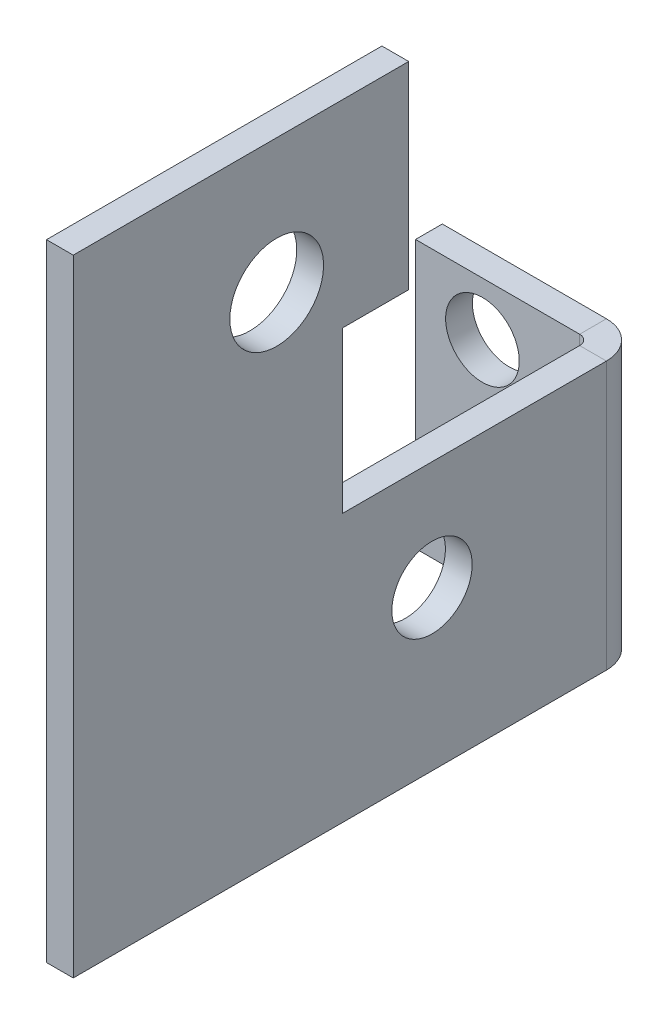
ISO-10303-21;
HEADER;
FILE_DESCRIPTION(('STEP AP214'),'2;1');
FILE_NAME('part.step','',(''),(''),'','','');
FILE_SCHEMA(('AUTOMOTIVE_DESIGN { 1 0 10303 214 1 1 1 1 }'));
ENDSEC;
DATA;
#1=APPLICATION_CONTEXT('core data for automotive mechanical design processes');
#2=APPLICATION_PROTOCOL_DEFINITION('international standard','automotive_design',2000,#1);
#3=PRODUCT_CONTEXT('',#1,'mechanical');
#4=PRODUCT('Part','Part','',(#3));
#5=PRODUCT_RELATED_PRODUCT_CATEGORY('part','',(#4));
#6=PRODUCT_DEFINITION_FORMATION('','',#4);
#7=PRODUCT_DEFINITION_CONTEXT('part definition',#1,'design');
#8=PRODUCT_DEFINITION('design','',#6,#7);
#9=PRODUCT_DEFINITION_SHAPE('','',#8);
#10=(LENGTH_UNIT() NAMED_UNIT(*) SI_UNIT(.MILLI.,.METRE.));
#11=(NAMED_UNIT(*) PLANE_ANGLE_UNIT() SI_UNIT($,.RADIAN.));
#12=(NAMED_UNIT(*) SI_UNIT($,.STERADIAN.) SOLID_ANGLE_UNIT());
#13=UNCERTAINTY_MEASURE_WITH_UNIT(LENGTH_MEASURE(1.E-05),#10,'distance_accuracy_value','');
#14=(GEOMETRIC_REPRESENTATION_CONTEXT(3) GLOBAL_UNCERTAINTY_ASSIGNED_CONTEXT((#13)) GLOBAL_UNIT_ASSIGNED_CONTEXT((#10,
#11,#12)) REPRESENTATION_CONTEXT('',''));
#15=CARTESIAN_POINT('',(0.,0.,0.));
#16=DIRECTION('',(0.,0.,1.));
#17=DIRECTION('',(1.,0.,0.));
#18=AXIS2_PLACEMENT_3D('',#15,#16,#17);
#19=CARTESIAN_POINT('',(2.,0.,35.2));
#20=DIRECTION('',(-1.,0.,0.));
#21=DIRECTION('',(0.,0.,1.));
#22=AXIS2_PLACEMENT_3D('',#19,#20,#21);
#23=PLANE('',#22);
#24=CARTESIAN_POINT('',(2.,40.,20.));
#25=DIRECTION('',(-1.,0.,0.));
#26=DIRECTION('',(0.,0.,1.));
#27=AXIS2_PLACEMENT_3D('',#24,#25,#26);
#28=CIRCLE('',#27,3.5);
#29=CARTESIAN_POINT('',(2.,40.,23.5));
#30=VERTEX_POINT('',#29);
#31=EDGE_CURVE('E256',#30,#30,#28,.T.);
#32=ORIENTED_EDGE('',*,*,#31,.T.);
#33=EDGE_LOOP('',(#32));
#34=FACE_BOUND('',#33,.T.);
#35=CARTESIAN_POINT('',(2.,15.0902098695956,8.3960026));
#36=DIRECTION('',(-1.,0.,0.));
#37=DIRECTION('',(0.,0.,1.));
#38=AXIS2_PLACEMENT_3D('',#35,#36,#37);
#39=CIRCLE('',#38,3.);
#40=CARTESIAN_POINT('',(2.,15.0902098695956,11.3960026));
#41=VERTEX_POINT('',#40);
#42=EDGE_CURVE('E229',#41,#41,#39,.T.);
#43=ORIENTED_EDGE('',*,*,#42,.T.);
#44=EDGE_LOOP('',(#43));
#45=FACE_BOUND('',#44,.T.);
#46=DIRECTION('',(0.,-1.,0.));
#47=VECTOR('',#46,1.);
#48=CARTESIAN_POINT('',(2.,3.23,-4.6334));
#49=LINE('',#48,#47);
#50=CARTESIAN_POINT('',(2.,3.23,-4.6334));
#51=VERTEX_POINT('',#50);
#52=CARTESIAN_POINT('',(2.,23.23,-4.6334));
#53=VERTEX_POINT('',#52);
#54=EDGE_CURVE('E156',#51,#53,#49,.F.);
#55=ORIENTED_EDGE('',*,*,#54,.T.);
#56=DIRECTION('',(0.,0.,1.));
#57=VECTOR('',#56,1.);
#58=CARTESIAN_POINT('',(2.,23.23,35.2));
#59=LINE('',#58,#57);
#60=CARTESIAN_POINT('',(2.,23.23,15.1));
#61=VERTEX_POINT('',#60);
#62=EDGE_CURVE('E248',#53,#61,#59,.T.);
#63=ORIENTED_EDGE('',*,*,#62,.T.);
#64=DIRECTION('',(0.,1.,0.));
#65=VECTOR('',#64,1.);
#66=CARTESIAN_POINT('',(2.,0.,15.1));
#67=LINE('',#66,#65);
#68=CARTESIAN_POINT('',(2.,35.23,15.1));
#69=VERTEX_POINT('',#68);
#70=EDGE_CURVE('E250',#61,#69,#67,.T.);
#71=ORIENTED_EDGE('',*,*,#70,.T.);
#72=DIRECTION('',(0.,0.,-1.));
#73=VECTOR('',#72,1.);
#74=CARTESIAN_POINT('',(2.,35.23,35.2));
#75=LINE('',#74,#73);
#76=CARTESIAN_POINT('',(2.,35.23,10.14));
#77=VERTEX_POINT('',#76);
#78=EDGE_CURVE('E244',#69,#77,#75,.T.);
#79=ORIENTED_EDGE('',*,*,#78,.T.);
#80=DIRECTION('',(0.,1.,0.));
#81=VECTOR('',#80,1.);
#82=CARTESIAN_POINT('',(2.,0.,10.14));
#83=LINE('',#82,#81);
#84=CARTESIAN_POINT('',(2.,50.,10.14));
#85=VERTEX_POINT('',#84);
#86=EDGE_CURVE('E222',#77,#85,#83,.T.);
#87=ORIENTED_EDGE('',*,*,#86,.T.);
#88=DIRECTION('',(0.,0.,-1.));
#89=VECTOR('',#88,1.);
#90=CARTESIAN_POINT('',(2.,50.,35.2));
#91=LINE('',#90,#89);
#92=CARTESIAN_POINT('',(2.,50.,35.2));
#93=VERTEX_POINT('',#92);
#94=EDGE_CURVE('E13',#93,#85,#91,.T.);
#95=ORIENTED_EDGE('',*,*,#94,.F.);
#96=DIRECTION('',(0.,1.,0.));
#97=VECTOR('',#96,1.);
#98=CARTESIAN_POINT('',(2.,0.,35.2));
#99=LINE('',#98,#97);
#100=CARTESIAN_POINT('',(2.,3.23,35.2));
#101=VERTEX_POINT('',#100);
#102=EDGE_CURVE('E265',#101,#93,#99,.T.);
#103=ORIENTED_EDGE('',*,*,#102,.F.);
#104=DIRECTION('',(0.,0.,1.));
#105=VECTOR('',#104,1.);
#106=CARTESIAN_POINT('',(2.,3.23,35.2));
#107=LINE('',#106,#105);
#108=EDGE_CURVE('E263',#51,#101,#107,.T.);
#109=ORIENTED_EDGE('',*,*,#108,.F.);
#110=EDGE_LOOP('',(#55,#63,#71,#79,#87,#95,#103,#109));
#111=FACE_BOUND('',#110,.T.);
#112=ADVANCED_FACE('F59',(#34,#45,#111),#23,.F.);
#113=CARTESIAN_POINT('',(0.,0.,35.2));
#114=DIRECTION('',(-1.,0.,0.));
#115=DIRECTION('',(0.,0.,1.));
#116=AXIS2_PLACEMENT_3D('',#113,#114,#115);
#117=PLANE('',#116);
#118=CARTESIAN_POINT('',(0.,15.0902098695956,8.3960026));
#119=DIRECTION('',(-1.,0.,0.));
#120=DIRECTION('',(0.,0.,1.));
#121=AXIS2_PLACEMENT_3D('',#118,#119,#120);
#122=CIRCLE('',#121,3.);
#123=CARTESIAN_POINT('',(0.,15.0902098695956,11.3960026));
#124=VERTEX_POINT('',#123);
#125=EDGE_CURVE('E226',#124,#124,#122,.T.);
#126=ORIENTED_EDGE('',*,*,#125,.F.);
#127=EDGE_LOOP('',(#126));
#128=FACE_BOUND('',#127,.T.);
#129=CARTESIAN_POINT('',(0.,40.,20.));
#130=DIRECTION('',(-1.,0.,0.));
#131=DIRECTION('',(0.,0.,1.));
#132=AXIS2_PLACEMENT_3D('',#129,#130,#131);
#133=CIRCLE('',#132,3.5);
#134=CARTESIAN_POINT('',(0.,40.,23.5));
#135=VERTEX_POINT('',#134);
#136=EDGE_CURVE('E253',#135,#135,#133,.T.);
#137=ORIENTED_EDGE('',*,*,#136,.F.);
#138=EDGE_LOOP('',(#137));
#139=FACE_BOUND('',#138,.T.);
#140=DIRECTION('',(0.,0.,1.));
#141=VECTOR('',#140,1.);
#142=CARTESIAN_POINT('',(0.,23.23,15.1));
#143=LINE('',#142,#141);
#144=CARTESIAN_POINT('',(0.,23.23,-4.6334));
#145=VERTEX_POINT('',#144);
#146=CARTESIAN_POINT('',(0.,23.23,15.1));
#147=VERTEX_POINT('',#146);
#148=EDGE_CURVE('E238',#145,#147,#143,.T.);
#149=ORIENTED_EDGE('',*,*,#148,.F.);
#150=DIRECTION('',(0.,-1.,0.));
#151=VECTOR('',#150,1.);
#152=CARTESIAN_POINT('',(0.,3.23,-4.6334));
#153=LINE('',#152,#151);
#154=CARTESIAN_POINT('',(0.,3.23,-4.6334));
#155=VERTEX_POINT('',#154);
#156=EDGE_CURVE('E73',#155,#145,#153,.F.);
#157=ORIENTED_EDGE('',*,*,#156,.F.);
#158=DIRECTION('',(0.,0.,-1.));
#159=VECTOR('',#158,1.);
#160=CARTESIAN_POINT('',(0.,3.23,35.2));
#161=LINE('',#160,#159);
#162=CARTESIAN_POINT('',(0.,3.23,35.2));
#163=VERTEX_POINT('',#162);
#164=EDGE_CURVE('E259',#163,#155,#161,.T.);
#165=ORIENTED_EDGE('',*,*,#164,.F.);
#166=DIRECTION('',(0.,1.,0.));
#167=VECTOR('',#166,1.);
#168=CARTESIAN_POINT('',(0.,0.,35.2));
#169=LINE('',#168,#167);
#170=CARTESIAN_POINT('',(0.,50.,35.2));
#171=VERTEX_POINT('',#170);
#172=EDGE_CURVE('E270',#163,#171,#169,.T.);
#173=ORIENTED_EDGE('',*,*,#172,.T.);
#174=DIRECTION('',(0.,0.,-1.));
#175=VECTOR('',#174,1.);
#176=CARTESIAN_POINT('',(0.,50.,35.2));
#177=LINE('',#176,#175);
#178=CARTESIAN_POINT('',(0.,50.,10.14));
#179=VERTEX_POINT('',#178);
#180=EDGE_CURVE('E66',#171,#179,#177,.T.);
#181=ORIENTED_EDGE('',*,*,#180,.T.);
#182=DIRECTION('',(0.,1.,0.));
#183=VECTOR('',#182,1.);
#184=CARTESIAN_POINT('',(0.,35.23,10.14));
#185=LINE('',#184,#183);
#186=CARTESIAN_POINT('',(0.,35.23,10.14));
#187=VERTEX_POINT('',#186);
#188=EDGE_CURVE('E214',#187,#179,#185,.T.);
#189=ORIENTED_EDGE('',*,*,#188,.F.);
#190=DIRECTION('',(0.,0.,-1.));
#191=VECTOR('',#190,1.);
#192=CARTESIAN_POINT('',(0.,35.23,15.1));
#193=LINE('',#192,#191);
#194=CARTESIAN_POINT('',(0.,35.23,15.1));
#195=VERTEX_POINT('',#194);
#196=EDGE_CURVE('E235',#195,#187,#193,.T.);
#197=ORIENTED_EDGE('',*,*,#196,.F.);
#198=DIRECTION('',(0.,1.,0.));
#199=VECTOR('',#198,1.);
#200=CARTESIAN_POINT('',(0.,35.23,15.1));
#201=LINE('',#200,#199);
#202=EDGE_CURVE('E232',#147,#195,#201,.T.);
#203=ORIENTED_EDGE('',*,*,#202,.F.);
#204=EDGE_LOOP('',(#149,#157,#165,#173,#181,#189,#197,#203));
#205=FACE_BOUND('',#204,.T.);
#206=ADVANCED_FACE('F274',(#128,#139,#205),#117,.T.);
#207=CARTESIAN_POINT('',(0.,3.23,0.));
#208=DIRECTION('',(0.,-1.,0.));
#209=DIRECTION('',(0.,0.,-1.));
#210=AXIS2_PLACEMENT_3D('',#207,#208,#209);
#211=PLANE('',#210);
#212=ORIENTED_EDGE('',*,*,#164,.T.);
#213=DIRECTION('',(1.,0.,0.));
#214=VECTOR('',#213,1.);
#215=CARTESIAN_POINT('',(0.,3.23,-4.6334));
#216=LINE('',#215,#214);
#217=EDGE_CURVE('E207',#155,#51,#216,.T.);
#218=ORIENTED_EDGE('',*,*,#217,.T.);
#219=ORIENTED_EDGE('',*,*,#108,.T.);
#220=DIRECTION('',(-1.,0.,0.));
#221=VECTOR('',#220,1.);
#222=CARTESIAN_POINT('',(0.,3.23,35.2));
#223=LINE('',#222,#221);
#224=EDGE_CURVE('E261',#101,#163,#223,.T.);
#225=ORIENTED_EDGE('',*,*,#224,.T.);
#226=EDGE_LOOP('',(#212,#218,#219,#225));
#227=FACE_BOUND('',#226,.T.);
#228=ADVANCED_FACE('F350',(#227),#211,.T.);
#229=CARTESIAN_POINT('',(10.,23.23,15.1));
#230=DIRECTION('',(0.,-1.,0.));
#231=DIRECTION('',(0.,0.,-1.));
#232=AXIS2_PLACEMENT_3D('',#229,#230,#231);
#233=PLANE('',#232);
#234=DIRECTION('',(1.,0.,0.));
#235=VECTOR('',#234,1.);
#236=CARTESIAN_POINT('',(0.,23.23,-4.6334));
#237=LINE('',#236,#235);
#238=EDGE_CURVE('E81',#145,#53,#237,.T.);
#239=ORIENTED_EDGE('',*,*,#238,.F.);
#240=ORIENTED_EDGE('',*,*,#148,.T.);
#241=DIRECTION('',(-1.,0.,0.));
#242=VECTOR('',#241,1.);
#243=CARTESIAN_POINT('',(10.,23.23,15.1));
#244=LINE('',#243,#242);
#245=EDGE_CURVE('E241',#61,#147,#244,.T.);
#246=ORIENTED_EDGE('',*,*,#245,.F.);
#247=ORIENTED_EDGE('',*,*,#62,.F.);
#248=EDGE_LOOP('',(#239,#240,#246,#247));
#249=FACE_BOUND('',#248,.T.);
#250=ADVANCED_FACE('F297',(#249),#233,.F.);
#251=CARTESIAN_POINT('',(0.,0.,35.2));
#252=DIRECTION('',(0.,0.,-1.));
#253=DIRECTION('',(-1.,0.,0.));
#254=AXIS2_PLACEMENT_3D('',#251,#252,#253);
#255=PLANE('',#254);
#256=ORIENTED_EDGE('',*,*,#224,.F.);
#257=ORIENTED_EDGE('',*,*,#102,.T.);
#258=DIRECTION('',(1.,0.,0.));
#259=VECTOR('',#258,1.);
#260=CARTESIAN_POINT('',(0.,50.,35.2));
#261=LINE('',#260,#259);
#262=EDGE_CURVE('E267',#171,#93,#261,.T.);
#263=ORIENTED_EDGE('',*,*,#262,.F.);
#264=ORIENTED_EDGE('',*,*,#172,.F.);
#265=EDGE_LOOP('',(#256,#257,#263,#264));
#266=FACE_BOUND('',#265,.T.);
#267=ADVANCED_FACE('F282',(#266),#255,.F.);
#268=CARTESIAN_POINT('',(0.,50.,35.2));
#269=DIRECTION('',(0.,1.,0.));
#270=DIRECTION('',(0.,0.,1.));
#271=AXIS2_PLACEMENT_3D('',#268,#269,#270);
#272=PLANE('',#271);
#273=DIRECTION('',(-1.,0.,0.));
#274=VECTOR('',#273,1.);
#275=CARTESIAN_POINT('',(8.,50.,10.14));
#276=LINE('',#275,#274);
#277=EDGE_CURVE('E219',#85,#179,#276,.T.);
#278=ORIENTED_EDGE('',*,*,#277,.T.);
#279=ORIENTED_EDGE('',*,*,#180,.F.);
#280=ORIENTED_EDGE('',*,*,#262,.T.);
#281=ORIENTED_EDGE('',*,*,#94,.T.);
#282=EDGE_LOOP('',(#278,#279,#280,#281));
#283=FACE_BOUND('',#282,.T.);
#284=ADVANCED_FACE('F279',(#283),#272,.T.);
#285=CARTESIAN_POINT('',(10.,40.,20.));
#286=DIRECTION('',(-1.,0.,0.));
#287=DIRECTION('',(0.,0.,1.));
#288=AXIS2_PLACEMENT_3D('',#285,#286,#287);
#289=CYLINDRICAL_SURFACE('',#288,3.5);
#290=ORIENTED_EDGE('',*,*,#136,.T.);
#291=EDGE_LOOP('',(#290));
#292=FACE_BOUND('',#291,.T.);
#293=ORIENTED_EDGE('',*,*,#31,.F.);
#294=EDGE_LOOP('',(#293));
#295=FACE_BOUND('',#294,.T.);
#296=ADVANCED_FACE('F373',(#292,#295),#289,.F.);
#297=CARTESIAN_POINT('',(10.,35.23,15.1));
#298=DIRECTION('',(0.,0.,1.));
#299=DIRECTION('',(0.,-1.,0.));
#300=AXIS2_PLACEMENT_3D('',#297,#298,#299);
#301=PLANE('',#300);
#302=ORIENTED_EDGE('',*,*,#245,.T.);
#303=ORIENTED_EDGE('',*,*,#202,.T.);
#304=DIRECTION('',(-1.,0.,0.));
#305=VECTOR('',#304,1.);
#306=CARTESIAN_POINT('',(10.,35.23,15.1));
#307=LINE('',#306,#305);
#308=EDGE_CURVE('E240',#69,#195,#307,.T.);
#309=ORIENTED_EDGE('',*,*,#308,.F.);
#310=ORIENTED_EDGE('',*,*,#70,.F.);
#311=EDGE_LOOP('',(#302,#303,#309,#310));
#312=FACE_BOUND('',#311,.T.);
#313=ADVANCED_FACE('F294',(#312),#301,.F.);
#314=CARTESIAN_POINT('',(10.,35.23,15.1));
#315=DIRECTION('',(0.,1.,0.));
#316=DIRECTION('',(0.,0.,1.));
#317=AXIS2_PLACEMENT_3D('',#314,#315,#316);
#318=PLANE('',#317);
#319=ORIENTED_EDGE('',*,*,#196,.T.);
#320=DIRECTION('',(-1.,0.,0.));
#321=VECTOR('',#320,1.);
#322=CARTESIAN_POINT('',(8.,35.23,10.14));
#323=LINE('',#322,#321);
#324=EDGE_CURVE('E218',#77,#187,#323,.T.);
#325=ORIENTED_EDGE('',*,*,#324,.F.);
#326=ORIENTED_EDGE('',*,*,#78,.F.);
#327=ORIENTED_EDGE('',*,*,#308,.T.);
#328=EDGE_LOOP('',(#319,#325,#326,#327));
#329=FACE_BOUND('',#328,.T.);
#330=ADVANCED_FACE('F290',(#329),#318,.F.);
#331=CARTESIAN_POINT('',(10.,15.0902098695956,8.3960026));
#332=DIRECTION('',(-1.,0.,0.));
#333=DIRECTION('',(0.,0.,1.));
#334=AXIS2_PLACEMENT_3D('',#331,#332,#333);
#335=CYLINDRICAL_SURFACE('',#334,3.);
#336=ORIENTED_EDGE('',*,*,#125,.T.);
#337=EDGE_LOOP('',(#336));
#338=FACE_BOUND('',#337,.T.);
#339=ORIENTED_EDGE('',*,*,#42,.F.);
#340=EDGE_LOOP('',(#339));
#341=FACE_BOUND('',#340,.T.);
#342=ADVANCED_FACE('F357',(#338,#341),#335,.F.);
#343=CARTESIAN_POINT('',(8.,35.23,10.14));
#344=DIRECTION('',(0.,0.,1.));
#345=DIRECTION('',(1.,0.,0.));
#346=AXIS2_PLACEMENT_3D('',#343,#344,#345);
#347=PLANE('',#346);
#348=ORIENTED_EDGE('',*,*,#324,.T.);
#349=ORIENTED_EDGE('',*,*,#188,.T.);
#350=ORIENTED_EDGE('',*,*,#277,.F.);
#351=ORIENTED_EDGE('',*,*,#86,.F.);
#352=EDGE_LOOP('',(#348,#349,#350,#351));
#353=FACE_BOUND('',#352,.T.);
#354=ADVANCED_FACE('F288',(#353),#347,.F.);
#355=CARTESIAN_POINT('',(-0.736599999999997,23.23,-4.6334));
#356=DIRECTION('',(0.,1.,0.));
#357=DIRECTION('',(0.,0.,1.));
#358=AXIS2_PLACEMENT_3D('',#355,#356,#357);
#359=PLANE('',#358);
#360=DIRECTION('',(0.,0.,-1.));
#361=VECTOR('',#360,1.);
#362=CARTESIAN_POINT('',(-0.736599999999997,23.23,-7.37000000000004));
#363=LINE('',#362,#361);
#364=CARTESIAN_POINT('',(-0.736599999999994,23.23,-5.37));
#365=VERTEX_POINT('',#364);
#366=CARTESIAN_POINT('',(-0.736599999999987,23.23,-7.37));
#367=VERTEX_POINT('',#366);
#368=EDGE_CURVE('E201',#365,#367,#363,.T.);
#369=ORIENTED_EDGE('',*,*,#368,.F.);
#370=CARTESIAN_POINT('',(-0.736599999999997,23.23,-4.6334));
#371=DIRECTION('',(0.,-1.,0.));
#372=DIRECTION('',(0.,0.,-1.));
#373=AXIS2_PLACEMENT_3D('',#370,#371,#372);
#374=CIRCLE('',#373,0.7366);
#375=EDGE_CURVE('E159',#145,#365,#374,.F.);
#376=ORIENTED_EDGE('',*,*,#375,.F.);
#377=ORIENTED_EDGE('',*,*,#238,.T.);
#378=CARTESIAN_POINT('',(-0.736599999999997,23.23,-4.6334));
#379=DIRECTION('',(0.,-1.,0.));
#380=DIRECTION('',(0.,0.,-1.));
#381=AXIS2_PLACEMENT_3D('',#378,#379,#380);
#382=CIRCLE('',#381,2.7366);
#383=EDGE_CURVE('E206',#53,#367,#382,.F.);
#384=ORIENTED_EDGE('',*,*,#383,.T.);
#385=EDGE_LOOP('',(#369,#376,#377,#384));
#386=FACE_BOUND('',#385,.T.);
#387=ADVANCED_FACE('F300',(#386),#359,.T.);
#388=CARTESIAN_POINT('',(-0.736599999999997,3.23,-4.6334));
#389=DIRECTION('',(0.,1.,0.));
#390=DIRECTION('',(0.,0.,1.));
#391=AXIS2_PLACEMENT_3D('',#388,#389,#390);
#392=PLANE('',#391);
#393=CARTESIAN_POINT('',(-0.736599999999997,3.23,-4.6334));
#394=DIRECTION('',(0.,-1.,0.));
#395=DIRECTION('',(0.,0.,-1.));
#396=AXIS2_PLACEMENT_3D('',#393,#394,#395);
#397=CIRCLE('',#396,0.7366);
#398=CARTESIAN_POINT('',(-0.736599999999994,3.23,-5.37));
#399=VERTEX_POINT('',#398);
#400=EDGE_CURVE('E166',#399,#155,#397,.T.);
#401=ORIENTED_EDGE('',*,*,#400,.F.);
#402=DIRECTION('',(0.,0.,-1.));
#403=VECTOR('',#402,1.);
#404=CARTESIAN_POINT('',(-0.736599999999997,3.23,-5.37));
#405=LINE('',#404,#403);
#406=CARTESIAN_POINT('',(-0.736599999999997,3.23,-7.37));
#407=VERTEX_POINT('',#406);
#408=EDGE_CURVE('E163',#399,#407,#405,.T.);
#409=ORIENTED_EDGE('',*,*,#408,.T.);
#410=CARTESIAN_POINT('',(-0.736599999999997,3.23,-4.6334));
#411=DIRECTION('',(0.,-1.,0.));
#412=DIRECTION('',(0.,0.,-1.));
#413=AXIS2_PLACEMENT_3D('',#410,#411,#412);
#414=CIRCLE('',#413,2.7366);
#415=EDGE_CURVE('E148',#407,#51,#414,.T.);
#416=ORIENTED_EDGE('',*,*,#415,.T.);
#417=ORIENTED_EDGE('',*,*,#217,.F.);
#418=EDGE_LOOP('',(#401,#409,#416,#417));
#419=FACE_BOUND('',#418,.T.);
#420=ADVANCED_FACE('F164',(#419),#392,.F.);
#421=CARTESIAN_POINT('',(-0.736599999999997,3.23,-4.6334));
#422=DIRECTION('',(0.,-1.,0.));
#423=DIRECTION('',(0.,0.,-1.));
#424=AXIS2_PLACEMENT_3D('',#421,#422,#423);
#425=CYLINDRICAL_SURFACE('',#424,2.7366);
#426=ORIENTED_EDGE('',*,*,#54,.F.);
#427=ORIENTED_EDGE('',*,*,#415,.F.);
#428=DIRECTION('',(0.,-1.,0.));
#429=VECTOR('',#428,1.);
#430=CARTESIAN_POINT('',(-0.736599999999997,0.,-7.37));
#431=LINE('',#430,#429);
#432=EDGE_CURVE('E153',#367,#407,#431,.T.);
#433=ORIENTED_EDGE('',*,*,#432,.F.);
#434=ORIENTED_EDGE('',*,*,#383,.F.);
#435=EDGE_LOOP('',(#426,#427,#433,#434));
#436=FACE_BOUND('',#435,.T.);
#437=ADVANCED_FACE('F150',(#436),#425,.T.);
#438=CARTESIAN_POINT('',(-0.736599999999997,3.23,-4.6334));
#439=DIRECTION('',(0.,-1.,0.));
#440=DIRECTION('',(0.,0.,-1.));
#441=AXIS2_PLACEMENT_3D('',#438,#439,#440);
#442=CYLINDRICAL_SURFACE('',#441,0.7366);
#443=ORIENTED_EDGE('',*,*,#156,.T.);
#444=ORIENTED_EDGE('',*,*,#375,.T.);
#445=DIRECTION('',(0.,1.,0.));
#446=VECTOR('',#445,1.);
#447=CARTESIAN_POINT('',(-0.736599999999997,23.23,-5.37));
#448=LINE('',#447,#446);
#449=EDGE_CURVE('E171',#365,#399,#448,.F.);
#450=ORIENTED_EDGE('',*,*,#449,.T.);
#451=ORIENTED_EDGE('',*,*,#400,.T.);
#452=EDGE_LOOP('',(#443,#444,#450,#451));
#453=FACE_BOUND('',#452,.T.);
#454=ADVANCED_FACE('F303',(#453),#442,.F.);
#455=CARTESIAN_POINT('',(0.,3.23,-7.37));
#456=DIRECTION('',(0.,-1.,0.));
#457=DIRECTION('',(0.,0.,-1.));
#458=AXIS2_PLACEMENT_3D('',#455,#456,#457);
#459=PLANE('',#458);
#460=DIRECTION('',(1.,0.,0.));
#461=VECTOR('',#460,1.);
#462=CARTESIAN_POINT('',(0.,3.23,-7.37));
#463=LINE('',#462,#461);
#464=CARTESIAN_POINT('',(-13.,3.23,-7.37000000000004));
#465=VERTEX_POINT('',#464);
#466=EDGE_CURVE('E178',#465,#407,#463,.T.);
#467=ORIENTED_EDGE('',*,*,#466,.T.);
#468=ORIENTED_EDGE('',*,*,#408,.F.);
#469=DIRECTION('',(-1.,0.,0.));
#470=VECTOR('',#469,1.);
#471=CARTESIAN_POINT('',(0.,3.23,-5.37));
#472=LINE('',#471,#470);
#473=CARTESIAN_POINT('',(-13.,3.23,-5.37000000000004));
#474=VERTEX_POINT('',#473);
#475=EDGE_CURVE('E194',#474,#399,#472,.F.);
#476=ORIENTED_EDGE('',*,*,#475,.F.);
#477=DIRECTION('',(0.,0.,1.));
#478=VECTOR('',#477,1.);
#479=CARTESIAN_POINT('',(-13.,3.23,-7.37000000000004));
#480=LINE('',#479,#478);
#481=EDGE_CURVE('E183',#465,#474,#480,.T.);
#482=ORIENTED_EDGE('',*,*,#481,.F.);
#483=EDGE_LOOP('',(#467,#468,#476,#482));
#484=FACE_BOUND('',#483,.T.);
#485=ADVANCED_FACE('F182',(#484),#459,.T.);
#486=CARTESIAN_POINT('',(-13.,23.23,-7.37000000000004));
#487=DIRECTION('',(0.,1.,0.));
#488=DIRECTION('',(0.,0.,1.));
#489=AXIS2_PLACEMENT_3D('',#486,#487,#488);
#490=PLANE('',#489);
#491=DIRECTION('',(1.,0.,0.));
#492=VECTOR('',#491,1.);
#493=CARTESIAN_POINT('',(0.,23.23,-5.37));
#494=LINE('',#493,#492);
#495=CARTESIAN_POINT('',(-13.,23.23,-5.37000000000004));
#496=VERTEX_POINT('',#495);
#497=EDGE_CURVE('E180',#365,#496,#494,.F.);
#498=ORIENTED_EDGE('',*,*,#497,.F.);
#499=ORIENTED_EDGE('',*,*,#368,.T.);
#500=DIRECTION('',(-1.,0.,0.));
#501=VECTOR('',#500,1.);
#502=CARTESIAN_POINT('',(-13.,23.23,-7.37000000000004));
#503=LINE('',#502,#501);
#504=CARTESIAN_POINT('',(-13.,23.23,-7.37000000000004));
#505=VERTEX_POINT('',#504);
#506=EDGE_CURVE('E179',#367,#505,#503,.T.);
#507=ORIENTED_EDGE('',*,*,#506,.T.);
#508=DIRECTION('',(0.,0.,1.));
#509=VECTOR('',#508,1.);
#510=CARTESIAN_POINT('',(-13.,23.23,-7.37000000000004));
#511=LINE('',#510,#509);
#512=EDGE_CURVE('E185',#505,#496,#511,.T.);
#513=ORIENTED_EDGE('',*,*,#512,.T.);
#514=EDGE_LOOP('',(#498,#499,#507,#513));
#515=FACE_BOUND('',#514,.T.);
#516=ADVANCED_FACE('F308',(#515),#490,.T.);
#517=CARTESIAN_POINT('',(0.,0.,-7.37));
#518=DIRECTION('',(0.,0.,-1.));
#519=DIRECTION('',(-1.,0.,0.));
#520=AXIS2_PLACEMENT_3D('',#517,#518,#519);
#521=PLANE('',#520);
#522=CARTESIAN_POINT('',(-8.00000000000001,7.23,-7.37000000000003));
#523=DIRECTION('',(0.,0.,-1.));
#524=DIRECTION('',(-1.,0.,0.));
#525=AXIS2_PLACEMENT_3D('',#522,#523,#524);
#526=CIRCLE('',#525,2.75);
#527=CARTESIAN_POINT('',(-10.75,7.23,-7.37000000000004));
#528=VERTEX_POINT('',#527);
#529=EDGE_CURVE('E319',#528,#528,#526,.T.);
#530=ORIENTED_EDGE('',*,*,#529,.F.);
#531=EDGE_LOOP('',(#530));
#532=FACE_BOUND('',#531,.T.);
#533=CARTESIAN_POINT('',(-8.00000000000001,19.23,-7.37000000000003));
#534=DIRECTION('',(0.,0.,-1.));
#535=DIRECTION('',(-1.,0.,0.));
#536=AXIS2_PLACEMENT_3D('',#533,#534,#535);
#537=CIRCLE('',#536,2.75);
#538=CARTESIAN_POINT('',(-10.75,19.23,-7.37000000000004));
#539=VERTEX_POINT('',#538);
#540=EDGE_CURVE('E204',#539,#539,#537,.T.);
#541=ORIENTED_EDGE('',*,*,#540,.F.);
#542=EDGE_LOOP('',(#541));
#543=FACE_BOUND('',#542,.T.);
#544=ORIENTED_EDGE('',*,*,#506,.F.);
#545=ORIENTED_EDGE('',*,*,#432,.T.);
#546=ORIENTED_EDGE('',*,*,#466,.F.);
#547=DIRECTION('',(0.,-1.,0.));
#548=VECTOR('',#547,1.);
#549=CARTESIAN_POINT('',(-13.,3.23,-7.37000000000004));
#550=LINE('',#549,#548);
#551=EDGE_CURVE('E186',#505,#465,#550,.T.);
#552=ORIENTED_EDGE('',*,*,#551,.F.);
#553=EDGE_LOOP('',(#544,#545,#546,#552));
#554=FACE_BOUND('',#553,.T.);
#555=ADVANCED_FACE('F176',(#532,#543,#554),#521,.T.);
#556=CARTESIAN_POINT('',(0.,0.,-5.37));
#557=DIRECTION('',(0.,0.,-1.));
#558=DIRECTION('',(-1.,0.,0.));
#559=AXIS2_PLACEMENT_3D('',#556,#557,#558);
#560=PLANE('',#559);
#561=CARTESIAN_POINT('',(-8.00000000000001,7.23,-5.37));
#562=DIRECTION('',(0.,0.,1.));
#563=DIRECTION('',(1.,0.,0.));
#564=AXIS2_PLACEMENT_3D('',#561,#562,#563);
#565=CIRCLE('',#564,2.75);
#566=CARTESIAN_POINT('',(-5.25000000000001,7.23,-5.37));
#567=VERTEX_POINT('',#566);
#568=EDGE_CURVE('E322',#567,#567,#565,.T.);
#569=ORIENTED_EDGE('',*,*,#568,.F.);
#570=EDGE_LOOP('',(#569));
#571=FACE_BOUND('',#570,.T.);
#572=CARTESIAN_POINT('',(-8.00000000000001,19.23,-5.37));
#573=DIRECTION('',(0.,0.,1.));
#574=DIRECTION('',(1.,0.,0.));
#575=AXIS2_PLACEMENT_3D('',#572,#573,#574);
#576=CIRCLE('',#575,2.75);
#577=CARTESIAN_POINT('',(-5.25000000000001,19.23,-5.37));
#578=VERTEX_POINT('',#577);
#579=EDGE_CURVE('E316',#578,#578,#576,.T.);
#580=ORIENTED_EDGE('',*,*,#579,.F.);
#581=EDGE_LOOP('',(#580));
#582=FACE_BOUND('',#581,.T.);
#583=ORIENTED_EDGE('',*,*,#449,.F.);
#584=ORIENTED_EDGE('',*,*,#497,.T.);
#585=DIRECTION('',(0.,1.,0.));
#586=VECTOR('',#585,1.);
#587=CARTESIAN_POINT('',(-13.,0.,-5.37000000000004));
#588=LINE('',#587,#586);
#589=EDGE_CURVE('E196',#496,#474,#588,.F.);
#590=ORIENTED_EDGE('',*,*,#589,.T.);
#591=ORIENTED_EDGE('',*,*,#475,.T.);
#592=EDGE_LOOP('',(#583,#584,#590,#591));
#593=FACE_BOUND('',#592,.T.);
#594=ADVANCED_FACE('F306',(#571,#582,#593),#560,.F.);
#595=CARTESIAN_POINT('',(-13.,3.23,-7.37000000000004));
#596=DIRECTION('',(-1.,0.,0.));
#597=DIRECTION('',(0.,0.,1.));
#598=AXIS2_PLACEMENT_3D('',#595,#596,#597);
#599=PLANE('',#598);
#600=ORIENTED_EDGE('',*,*,#589,.F.);
#601=ORIENTED_EDGE('',*,*,#512,.F.);
#602=ORIENTED_EDGE('',*,*,#551,.T.);
#603=ORIENTED_EDGE('',*,*,#481,.T.);
#604=EDGE_LOOP('',(#600,#601,#602,#603));
#605=FACE_BOUND('',#604,.T.);
#606=ADVANCED_FACE('F312',(#605),#599,.T.);
#607=CARTESIAN_POINT('',(-8.00000000000001,19.23,-14.88));
#608=DIRECTION('',(0.,0.,1.));
#609=DIRECTION('',(1.,0.,0.));
#610=AXIS2_PLACEMENT_3D('',#607,#608,#609);
#611=CYLINDRICAL_SURFACE('',#610,2.75);
#612=ORIENTED_EDGE('',*,*,#540,.T.);
#613=EDGE_LOOP('',(#612));
#614=FACE_BOUND('',#613,.T.);
#615=ORIENTED_EDGE('',*,*,#579,.T.);
#616=EDGE_LOOP('',(#615));
#617=FACE_BOUND('',#616,.T.);
#618=ADVANCED_FACE('F333',(#614,#617),#611,.F.);
#619=CARTESIAN_POINT('',(-8.00000000000001,7.23,-14.88));
#620=DIRECTION('',(0.,0.,1.));
#621=DIRECTION('',(1.,0.,0.));
#622=AXIS2_PLACEMENT_3D('',#619,#620,#621);
#623=CYLINDRICAL_SURFACE('',#622,2.75);
#624=ORIENTED_EDGE('',*,*,#529,.T.);
#625=EDGE_LOOP('',(#624));
#626=FACE_BOUND('',#625,.T.);
#627=ORIENTED_EDGE('',*,*,#568,.T.);
#628=EDGE_LOOP('',(#627));
#629=FACE_BOUND('',#628,.T.);
#630=ADVANCED_FACE('F326',(#626,#629),#623,.F.);
#631=CLOSED_SHELL('',(#112,#206,#228,#250,#267,#284,#296,#313,#330,#342,#354,#387,#420,#437,
#454,#485,#516,#555,#594,#606,#618,#630));
#632=MANIFOLD_SOLID_BREP('B2',#631);
#633=ADVANCED_BREP_SHAPE_REPRESENTATION('',(#18,#632),#14);
#634=SHAPE_DEFINITION_REPRESENTATION(#9,#633);
ENDSEC;
END-ISO-10303-21;
